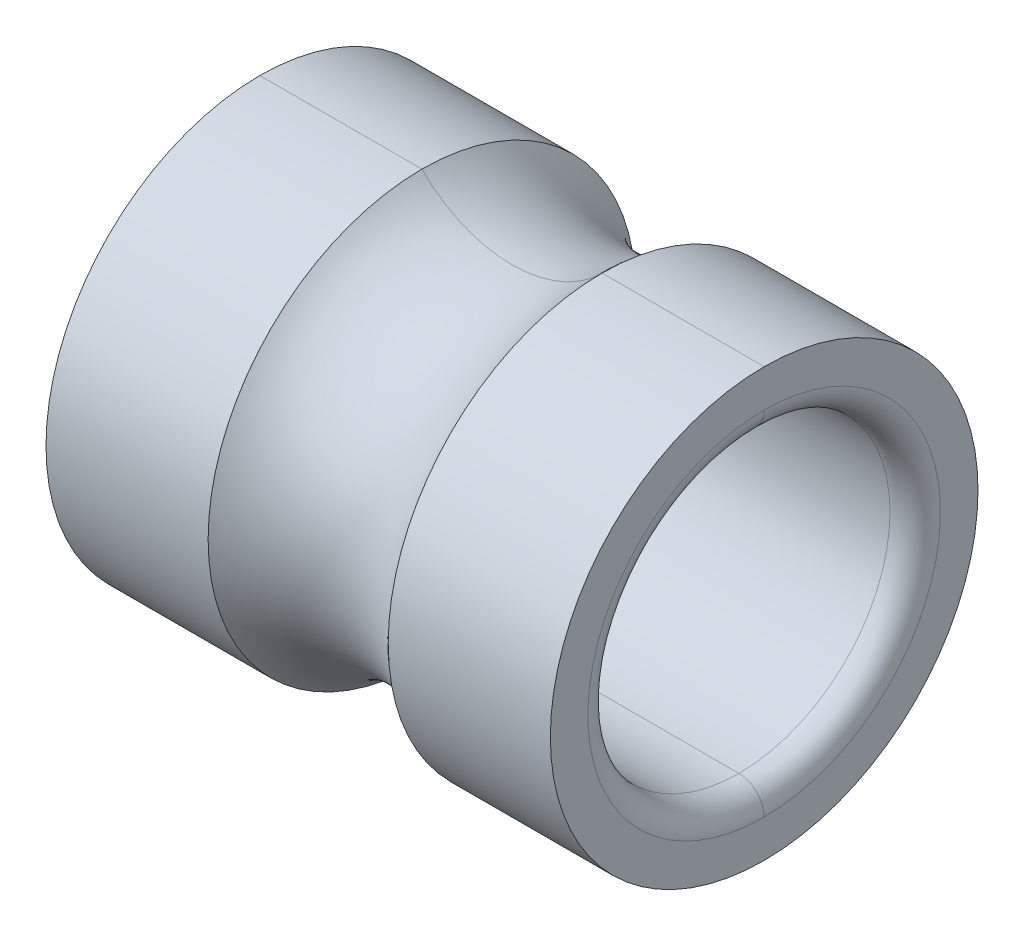
ISO-10303-21;
HEADER;
FILE_DESCRIPTION(('STEP AP214'),'2;1');
FILE_NAME('part.step','',(''),(''),'','','');
FILE_SCHEMA(('AUTOMOTIVE_DESIGN { 1 0 10303 214 1 1 1 1 }'));
ENDSEC;
DATA;
#1=APPLICATION_CONTEXT('core data for automotive mechanical design processes');
#2=APPLICATION_PROTOCOL_DEFINITION('international standard','automotive_design',2000,#1);
#3=PRODUCT_CONTEXT('',#1,'mechanical');
#4=PRODUCT('Part','Part','',(#3));
#5=PRODUCT_RELATED_PRODUCT_CATEGORY('part','',(#4));
#6=PRODUCT_DEFINITION_FORMATION('','',#4);
#7=PRODUCT_DEFINITION_CONTEXT('part definition',#1,'design');
#8=PRODUCT_DEFINITION('design','',#6,#7);
#9=PRODUCT_DEFINITION_SHAPE('','',#8);
#10=(LENGTH_UNIT() NAMED_UNIT(*) SI_UNIT(.MILLI.,.METRE.));
#11=(NAMED_UNIT(*) PLANE_ANGLE_UNIT() SI_UNIT($,.RADIAN.));
#12=(NAMED_UNIT(*) SI_UNIT($,.STERADIAN.) SOLID_ANGLE_UNIT());
#13=UNCERTAINTY_MEASURE_WITH_UNIT(LENGTH_MEASURE(1.E-05),#10,'distance_accuracy_value','');
#14=(GEOMETRIC_REPRESENTATION_CONTEXT(3) GLOBAL_UNCERTAINTY_ASSIGNED_CONTEXT((#13)) GLOBAL_UNIT_ASSIGNED_CONTEXT((#10,
#11,#12)) REPRESENTATION_CONTEXT('',''));
#15=CARTESIAN_POINT('',(0.,0.,0.));
#16=DIRECTION('',(0.,0.,1.));
#17=DIRECTION('',(1.,0.,0.));
#18=AXIS2_PLACEMENT_3D('',#15,#16,#17);
#19=CARTESIAN_POINT('',(-2.75209,0.,0.));
#20=DIRECTION('',(1.,0.,0.));
#21=DIRECTION('',(0.,-1.,0.));
#22=AXIS2_PLACEMENT_3D('',#19,#20,#21);
#23=CYLINDRICAL_SURFACE('',#22,1.4986);
#24=CARTESIAN_POINT('',(-2.25171,0.,0.));
#25=DIRECTION('',(-1.,0.,0.));
#26=DIRECTION('',(0.,1.,0.));
#27=AXIS2_PLACEMENT_3D('',#24,#25,#26);
#28=CIRCLE('',#27,1.4986);
#29=CARTESIAN_POINT('',(-2.25171,1.4986,0.));
#30=VERTEX_POINT('',#29);
#31=CARTESIAN_POINT('',(-2.25171,-1.4986,0.));
#32=VERTEX_POINT('',#31);
#33=EDGE_CURVE('E20',#30,#32,#28,.T.);
#34=ORIENTED_EDGE('',*,*,#33,.T.);
#35=DIRECTION('',(1.,0.,0.));
#36=VECTOR('',#35,1.);
#37=CARTESIAN_POINT('',(-2.25171,-1.4986,0.));
#38=LINE('',#37,#36);
#39=CARTESIAN_POINT('',(2.25171,-1.4986,0.));
#40=VERTEX_POINT('',#39);
#41=EDGE_CURVE('E11',#32,#40,#38,.T.);
#42=ORIENTED_EDGE('',*,*,#41,.T.);
#43=CARTESIAN_POINT('',(2.25171,0.,0.));
#44=DIRECTION('',(-1.,0.,0.));
#45=DIRECTION('',(0.,1.,0.));
#46=AXIS2_PLACEMENT_3D('',#43,#44,#45);
#47=CIRCLE('',#46,1.4986);
#48=CARTESIAN_POINT('',(2.25171,1.4986,0.));
#49=VERTEX_POINT('',#48);
#50=EDGE_CURVE('E85',#49,#40,#47,.T.);
#51=ORIENTED_EDGE('',*,*,#50,.F.);
#52=DIRECTION('',(1.,0.,0.));
#53=VECTOR('',#52,1.);
#54=CARTESIAN_POINT('',(-2.25171,1.4986,0.));
#55=LINE('',#54,#53);
#56=EDGE_CURVE('E25',#30,#49,#55,.T.);
#57=ORIENTED_EDGE('',*,*,#56,.F.);
#58=EDGE_LOOP('',(#34,#42,#51,#57));
#59=FACE_BOUND('',#58,.T.);
#60=ADVANCED_FACE('F17',(#59),#23,.F.);
#61=CARTESIAN_POINT('',(-2.75209,0.,0.));
#62=DIRECTION('',(1.,0.,0.));
#63=DIRECTION('',(0.,-1.,0.));
#64=AXIS2_PLACEMENT_3D('',#61,#62,#63);
#65=CYLINDRICAL_SURFACE('',#64,1.4986);
#66=CARTESIAN_POINT('',(2.25171,0.,0.));
#67=DIRECTION('',(1.,0.,0.));
#68=DIRECTION('',(0.,1.,0.));
#69=AXIS2_PLACEMENT_3D('',#66,#67,#68);
#70=CIRCLE('',#69,1.4986);
#71=EDGE_CURVE('E89',#49,#40,#70,.T.);
#72=ORIENTED_EDGE('',*,*,#71,.T.);
#73=ORIENTED_EDGE('',*,*,#41,.F.);
#74=CARTESIAN_POINT('',(-2.25171,0.,0.));
#75=DIRECTION('',(1.,0.,0.));
#76=DIRECTION('',(0.,1.,0.));
#77=AXIS2_PLACEMENT_3D('',#74,#75,#76);
#78=CIRCLE('',#77,1.4986);
#79=EDGE_CURVE('E92',#30,#32,#78,.T.);
#80=ORIENTED_EDGE('',*,*,#79,.F.);
#81=ORIENTED_EDGE('',*,*,#56,.T.);
#82=EDGE_LOOP('',(#72,#73,#80,#81));
#83=FACE_BOUND('',#82,.T.);
#84=ADVANCED_FACE('F94',(#83),#65,.F.);
#85=CARTESIAN_POINT('',(2.25171,0.,0.));
#86=DIRECTION('',(1.,0.,0.));
#87=DIRECTION('',(0.,-1.,0.));
#88=AXIS2_PLACEMENT_3D('',#85,#86,#87);
#89=TOROIDAL_SURFACE('',#88,1.74879,0.25019);
#90=CARTESIAN_POINT('',(2.5019,0.,0.));
#91=DIRECTION('',(1.,0.,0.));
#92=DIRECTION('',(0.,1.,0.));
#93=AXIS2_PLACEMENT_3D('',#90,#91,#92);
#94=CIRCLE('',#93,1.74879);
#95=CARTESIAN_POINT('',(2.5019,1.74879,0.));
#96=VERTEX_POINT('',#95);
#97=CARTESIAN_POINT('',(2.5019,-1.74879,0.));
#98=VERTEX_POINT('',#97);
#99=EDGE_CURVE('E148',#96,#98,#94,.T.);
#100=ORIENTED_EDGE('',*,*,#99,.T.);
#101=CARTESIAN_POINT('',(2.25171,-1.74879,0.));
#102=DIRECTION('',(0.,0.,-1.));
#103=DIRECTION('',(0.,1.,0.));
#104=AXIS2_PLACEMENT_3D('',#101,#102,#103);
#105=CIRCLE('',#104,0.25019);
#106=EDGE_CURVE('E152',#40,#98,#105,.T.);
#107=ORIENTED_EDGE('',*,*,#106,.F.);
#108=ORIENTED_EDGE('',*,*,#71,.F.);
#109=CARTESIAN_POINT('',(2.25171,1.74879,0.));
#110=DIRECTION('',(0.,0.,1.));
#111=DIRECTION('',(0.,-1.,0.));
#112=AXIS2_PLACEMENT_3D('',#109,#110,#111);
#113=CIRCLE('',#112,0.25019);
#114=EDGE_CURVE('E150',#49,#96,#113,.T.);
#115=ORIENTED_EDGE('',*,*,#114,.T.);
#116=EDGE_LOOP('',(#100,#107,#108,#115));
#117=FACE_BOUND('',#116,.T.);
#118=ADVANCED_FACE('F159',(#117),#89,.T.);
#119=CARTESIAN_POINT('',(2.25171,0.,0.));
#120=DIRECTION('',(1.,0.,0.));
#121=DIRECTION('',(0.,-1.,0.));
#122=AXIS2_PLACEMENT_3D('',#119,#120,#121);
#123=TOROIDAL_SURFACE('',#122,1.74879,0.25019);
#124=ORIENTED_EDGE('',*,*,#50,.T.);
#125=ORIENTED_EDGE('',*,*,#106,.T.);
#126=CARTESIAN_POINT('',(2.5019,0.,0.));
#127=DIRECTION('',(-1.,0.,0.));
#128=DIRECTION('',(0.,1.,0.));
#129=AXIS2_PLACEMENT_3D('',#126,#127,#128);
#130=CIRCLE('',#129,1.74879);
#131=EDGE_CURVE('E145',#96,#98,#130,.T.);
#132=ORIENTED_EDGE('',*,*,#131,.F.);
#133=ORIENTED_EDGE('',*,*,#114,.F.);
#134=EDGE_LOOP('',(#124,#125,#132,#133));
#135=FACE_BOUND('',#134,.T.);
#136=ADVANCED_FACE('F163',(#135),#123,.T.);
#137=CARTESIAN_POINT('',(2.5019,0.,0.));
#138=DIRECTION('',(1.,0.,0.));
#139=DIRECTION('',(0.,-1.,0.));
#140=AXIS2_PLACEMENT_3D('',#137,#138,#139);
#141=PLANE('',#140);
#142=ORIENTED_EDGE('',*,*,#99,.F.);
#143=ORIENTED_EDGE('',*,*,#131,.T.);
#144=EDGE_LOOP('',(#142,#143));
#145=FACE_BOUND('',#144,.T.);
#146=CARTESIAN_POINT('',(2.5019,0.,0.));
#147=DIRECTION('',(-1.,0.,0.));
#148=DIRECTION('',(0.,1.,0.));
#149=AXIS2_PLACEMENT_3D('',#146,#147,#148);
#150=CIRCLE('',#149,2.121535);
#151=CARTESIAN_POINT('',(2.5019,2.121535,0.));
#152=VERTEX_POINT('',#151);
#153=CARTESIAN_POINT('',(2.5019,-2.121535,0.));
#154=VERTEX_POINT('',#153);
#155=EDGE_CURVE('E140',#152,#154,#150,.T.);
#156=ORIENTED_EDGE('',*,*,#155,.F.);
#157=CARTESIAN_POINT('',(2.5019,0.,0.));
#158=DIRECTION('',(1.,0.,0.));
#159=DIRECTION('',(0.,1.,0.));
#160=AXIS2_PLACEMENT_3D('',#157,#158,#159);
#161=CIRCLE('',#160,2.121535);
#162=EDGE_CURVE('E143',#152,#154,#161,.T.);
#163=ORIENTED_EDGE('',*,*,#162,.T.);
#164=EDGE_LOOP('',(#156,#163));
#165=FACE_BOUND('',#164,.T.);
#166=ADVANCED_FACE('F165',(#145,#165),#141,.T.);
#167=CARTESIAN_POINT('',(-2.75209,0.,0.));
#168=DIRECTION('',(1.,0.,0.));
#169=DIRECTION('',(0.,-1.,0.));
#170=AXIS2_PLACEMENT_3D('',#167,#168,#169);
#171=CYLINDRICAL_SURFACE('',#170,2.121535);
#172=CARTESIAN_POINT('',(0.893356989268568,0.,0.));
#173=DIRECTION('',(1.,0.,0.));
#174=DIRECTION('',(0.,1.,0.));
#175=AXIS2_PLACEMENT_3D('',#172,#173,#174);
#176=CIRCLE('',#175,2.121535);
#177=CARTESIAN_POINT('',(0.893356989268567,2.121535,0.));
#178=VERTEX_POINT('',#177);
#179=CARTESIAN_POINT('',(0.893356989268567,-2.121535,0.));
#180=VERTEX_POINT('',#179);
#181=EDGE_CURVE('E126',#178,#180,#176,.T.);
#182=ORIENTED_EDGE('',*,*,#181,.T.);
#183=DIRECTION('',(-1.,0.,0.));
#184=VECTOR('',#183,1.);
#185=CARTESIAN_POINT('',(2.5019,-2.121535,0.));
#186=LINE('',#185,#184);
#187=EDGE_CURVE('E137',#154,#180,#186,.T.);
#188=ORIENTED_EDGE('',*,*,#187,.F.);
#189=ORIENTED_EDGE('',*,*,#162,.F.);
#190=DIRECTION('',(-1.,0.,0.));
#191=VECTOR('',#190,1.);
#192=CARTESIAN_POINT('',(2.5019,2.121535,0.));
#193=LINE('',#192,#191);
#194=EDGE_CURVE('E135',#152,#178,#193,.T.);
#195=ORIENTED_EDGE('',*,*,#194,.T.);
#196=EDGE_LOOP('',(#182,#188,#189,#195));
#197=FACE_BOUND('',#196,.T.);
#198=ADVANCED_FACE('F168',(#197),#171,.T.);
#199=CARTESIAN_POINT('',(-2.75209,0.,0.));
#200=DIRECTION('',(1.,0.,0.));
#201=DIRECTION('',(0.,-1.,0.));
#202=AXIS2_PLACEMENT_3D('',#199,#200,#201);
#203=CYLINDRICAL_SURFACE('',#202,2.121535);
#204=ORIENTED_EDGE('',*,*,#155,.T.);
#205=ORIENTED_EDGE('',*,*,#187,.T.);
#206=CARTESIAN_POINT('',(0.893356989268568,0.,0.));
#207=DIRECTION('',(-1.,0.,0.));
#208=DIRECTION('',(0.,1.,0.));
#209=AXIS2_PLACEMENT_3D('',#206,#207,#208);
#210=CIRCLE('',#209,2.121535);
#211=EDGE_CURVE('E132',#178,#180,#210,.T.);
#212=ORIENTED_EDGE('',*,*,#211,.F.);
#213=ORIENTED_EDGE('',*,*,#194,.F.);
#214=EDGE_LOOP('',(#204,#205,#212,#213));
#215=FACE_BOUND('',#214,.T.);
#216=ADVANCED_FACE('F176',(#215),#203,.T.);
#217=CARTESIAN_POINT('',(0.,0.,0.));
#218=DIRECTION('',(1.,0.,0.));
#219=DIRECTION('',(0.,-1.,0.));
#220=AXIS2_PLACEMENT_3D('',#217,#218,#219);
#221=TOROIDAL_SURFACE('',#220,2.9972,1.25095);
#222=ORIENTED_EDGE('',*,*,#211,.T.);
#223=CARTESIAN_POINT('',(0.,-2.9972,0.));
#224=DIRECTION('',(0.,0.,1.));
#225=DIRECTION('',(0.714142842854284,0.700000000000001,0.));
#226=AXIS2_PLACEMENT_3D('',#223,#224,#225);
#227=CIRCLE('',#226,1.25095);
#228=CARTESIAN_POINT('',(-0.893356989268568,-2.121535,0.));
#229=VERTEX_POINT('',#228);
#230=EDGE_CURVE('E128',#180,#229,#227,.T.);
#231=ORIENTED_EDGE('',*,*,#230,.T.);
#232=CARTESIAN_POINT('',(-0.893356989268567,0.,0.));
#233=DIRECTION('',(-1.,0.,0.));
#234=DIRECTION('',(0.,1.,0.));
#235=AXIS2_PLACEMENT_3D('',#232,#233,#234);
#236=CIRCLE('',#235,2.121535);
#237=CARTESIAN_POINT('',(-0.893356989268568,2.121535,0.));
#238=VERTEX_POINT('',#237);
#239=EDGE_CURVE('E119',#238,#229,#236,.T.);
#240=ORIENTED_EDGE('',*,*,#239,.F.);
#241=CARTESIAN_POINT('',(0.,2.9972,0.));
#242=DIRECTION('',(0.,0.,-1.));
#243=DIRECTION('',(0.714142842854284,-0.700000000000001,0.));
#244=AXIS2_PLACEMENT_3D('',#241,#242,#243);
#245=CIRCLE('',#244,1.25095);
#246=EDGE_CURVE('E125',#178,#238,#245,.T.);
#247=ORIENTED_EDGE('',*,*,#246,.F.);
#248=EDGE_LOOP('',(#222,#231,#240,#247));
#249=FACE_BOUND('',#248,.T.);
#250=ADVANCED_FACE('F181',(#249),#221,.F.);
#251=CARTESIAN_POINT('',(0.,0.,0.));
#252=DIRECTION('',(1.,0.,0.));
#253=DIRECTION('',(0.,-1.,0.));
#254=AXIS2_PLACEMENT_3D('',#251,#252,#253);
#255=TOROIDAL_SURFACE('',#254,2.9972,1.25095);
#256=CARTESIAN_POINT('',(-0.893356989268567,0.,0.));
#257=DIRECTION('',(1.,0.,0.));
#258=DIRECTION('',(0.,1.,0.));
#259=AXIS2_PLACEMENT_3D('',#256,#257,#258);
#260=CIRCLE('',#259,2.121535);
#261=EDGE_CURVE('E122',#238,#229,#260,.T.);
#262=ORIENTED_EDGE('',*,*,#261,.T.);
#263=ORIENTED_EDGE('',*,*,#230,.F.);
#264=ORIENTED_EDGE('',*,*,#181,.F.);
#265=ORIENTED_EDGE('',*,*,#246,.T.);
#266=EDGE_LOOP('',(#262,#263,#264,#265));
#267=FACE_BOUND('',#266,.T.);
#268=ADVANCED_FACE('F184',(#267),#255,.F.);
#269=CARTESIAN_POINT('',(-2.75209,0.,0.));
#270=DIRECTION('',(1.,0.,0.));
#271=DIRECTION('',(0.,-1.,0.));
#272=AXIS2_PLACEMENT_3D('',#269,#270,#271);
#273=CYLINDRICAL_SURFACE('',#272,2.121535);
#274=CARTESIAN_POINT('',(-2.5019,0.,0.));
#275=DIRECTION('',(1.,0.,0.));
#276=DIRECTION('',(0.,1.,0.));
#277=AXIS2_PLACEMENT_3D('',#274,#275,#276);
#278=CIRCLE('',#277,2.121535);
#279=CARTESIAN_POINT('',(-2.5019,2.121535,0.));
#280=VERTEX_POINT('',#279);
#281=CARTESIAN_POINT('',(-2.5019,-2.121535,0.));
#282=VERTEX_POINT('',#281);
#283=EDGE_CURVE('E39',#280,#282,#278,.T.);
#284=ORIENTED_EDGE('',*,*,#283,.T.);
#285=DIRECTION('',(-1.,0.,0.));
#286=VECTOR('',#285,1.);
#287=CARTESIAN_POINT('',(-0.893356989268568,-2.121535,0.));
#288=LINE('',#287,#286);
#289=EDGE_CURVE('E117',#229,#282,#288,.T.);
#290=ORIENTED_EDGE('',*,*,#289,.F.);
#291=ORIENTED_EDGE('',*,*,#261,.F.);
#292=DIRECTION('',(-1.,0.,0.));
#293=VECTOR('',#292,1.);
#294=CARTESIAN_POINT('',(-0.893356989268568,2.121535,0.));
#295=LINE('',#294,#293);
#296=EDGE_CURVE('E115',#238,#280,#295,.T.);
#297=ORIENTED_EDGE('',*,*,#296,.T.);
#298=EDGE_LOOP('',(#284,#290,#291,#297));
#299=FACE_BOUND('',#298,.T.);
#300=ADVANCED_FACE('F186',(#299),#273,.T.);
#301=CARTESIAN_POINT('',(-2.75209,0.,0.));
#302=DIRECTION('',(1.,0.,0.));
#303=DIRECTION('',(0.,-1.,0.));
#304=AXIS2_PLACEMENT_3D('',#301,#302,#303);
#305=CYLINDRICAL_SURFACE('',#304,2.121535);
#306=ORIENTED_EDGE('',*,*,#239,.T.);
#307=ORIENTED_EDGE('',*,*,#289,.T.);
#308=CARTESIAN_POINT('',(-2.5019,0.,0.));
#309=DIRECTION('',(-1.,0.,0.));
#310=DIRECTION('',(0.,1.,0.));
#311=AXIS2_PLACEMENT_3D('',#308,#309,#310);
#312=CIRCLE('',#311,2.121535);
#313=EDGE_CURVE('E97',#280,#282,#312,.T.);
#314=ORIENTED_EDGE('',*,*,#313,.F.);
#315=ORIENTED_EDGE('',*,*,#296,.F.);
#316=EDGE_LOOP('',(#306,#307,#314,#315));
#317=FACE_BOUND('',#316,.T.);
#318=ADVANCED_FACE('F189',(#317),#305,.T.);
#319=CARTESIAN_POINT('',(-2.5019,0.,0.));
#320=DIRECTION('',(1.,0.,0.));
#321=DIRECTION('',(0.,-1.,0.));
#322=AXIS2_PLACEMENT_3D('',#319,#320,#321);
#323=PLANE('',#322);
#324=CARTESIAN_POINT('',(-2.5019,0.,0.));
#325=DIRECTION('',(-1.,0.,0.));
#326=DIRECTION('',(0.,1.,0.));
#327=AXIS2_PLACEMENT_3D('',#324,#325,#326);
#328=CIRCLE('',#327,1.74879);
#329=CARTESIAN_POINT('',(-2.5019,1.74879,0.));
#330=VERTEX_POINT('',#329);
#331=CARTESIAN_POINT('',(-2.5019,-1.74879,0.));
#332=VERTEX_POINT('',#331);
#333=EDGE_CURVE('E107',#330,#332,#328,.T.);
#334=ORIENTED_EDGE('',*,*,#333,.F.);
#335=CARTESIAN_POINT('',(-2.5019,0.,0.));
#336=DIRECTION('',(1.,0.,0.));
#337=DIRECTION('',(0.,1.,0.));
#338=AXIS2_PLACEMENT_3D('',#335,#336,#337);
#339=CIRCLE('',#338,1.74879);
#340=EDGE_CURVE('E31',#330,#332,#339,.T.);
#341=ORIENTED_EDGE('',*,*,#340,.T.);
#342=EDGE_LOOP('',(#334,#341));
#343=FACE_BOUND('',#342,.T.);
#344=ORIENTED_EDGE('',*,*,#283,.F.);
#345=ORIENTED_EDGE('',*,*,#313,.T.);
#346=EDGE_LOOP('',(#344,#345));
#347=FACE_BOUND('',#346,.T.);
#348=ADVANCED_FACE('F191',(#343,#347),#323,.F.);
#349=CARTESIAN_POINT('',(-2.25171,0.,0.));
#350=DIRECTION('',(1.,0.,0.));
#351=DIRECTION('',(0.,-1.,0.));
#352=AXIS2_PLACEMENT_3D('',#349,#350,#351);
#353=TOROIDAL_SURFACE('',#352,1.74879,0.25019);
#354=ORIENTED_EDGE('',*,*,#79,.T.);
#355=CARTESIAN_POINT('',(-2.25171,-1.74879,0.));
#356=DIRECTION('',(0.,0.,-1.));
#357=DIRECTION('',(-1.,0.,0.));
#358=AXIS2_PLACEMENT_3D('',#355,#356,#357);
#359=CIRCLE('',#358,0.25019);
#360=EDGE_CURVE('E106',#332,#32,#359,.T.);
#361=ORIENTED_EDGE('',*,*,#360,.F.);
#362=ORIENTED_EDGE('',*,*,#340,.F.);
#363=CARTESIAN_POINT('',(-2.25171,1.74879,0.));
#364=DIRECTION('',(0.,0.,1.));
#365=DIRECTION('',(-1.,0.,0.));
#366=AXIS2_PLACEMENT_3D('',#363,#364,#365);
#367=CIRCLE('',#366,0.25019);
#368=EDGE_CURVE('E100',#330,#30,#367,.T.);
#369=ORIENTED_EDGE('',*,*,#368,.T.);
#370=EDGE_LOOP('',(#354,#361,#362,#369));
#371=FACE_BOUND('',#370,.T.);
#372=ADVANCED_FACE('F101',(#371),#353,.T.);
#373=CARTESIAN_POINT('',(-2.25171,0.,0.));
#374=DIRECTION('',(1.,0.,0.));
#375=DIRECTION('',(0.,-1.,0.));
#376=AXIS2_PLACEMENT_3D('',#373,#374,#375);
#377=TOROIDAL_SURFACE('',#376,1.74879,0.25019);
#378=ORIENTED_EDGE('',*,*,#333,.T.);
#379=ORIENTED_EDGE('',*,*,#360,.T.);
#380=ORIENTED_EDGE('',*,*,#33,.F.);
#381=ORIENTED_EDGE('',*,*,#368,.F.);
#382=EDGE_LOOP('',(#378,#379,#380,#381));
#383=FACE_BOUND('',#382,.T.);
#384=ADVANCED_FACE('F105',(#383),#377,.T.);
#385=CLOSED_SHELL('',(#60,#84,#118,#136,#166,#198,#216,#250,#268,#300,#318,#348,#372,#384));
#386=MANIFOLD_SOLID_BREP('B1',#385);
#387=ADVANCED_BREP_SHAPE_REPRESENTATION('',(#18,#386),#14);
#388=SHAPE_DEFINITION_REPRESENTATION(#9,#387);
ENDSEC;
END-ISO-10303-21;
